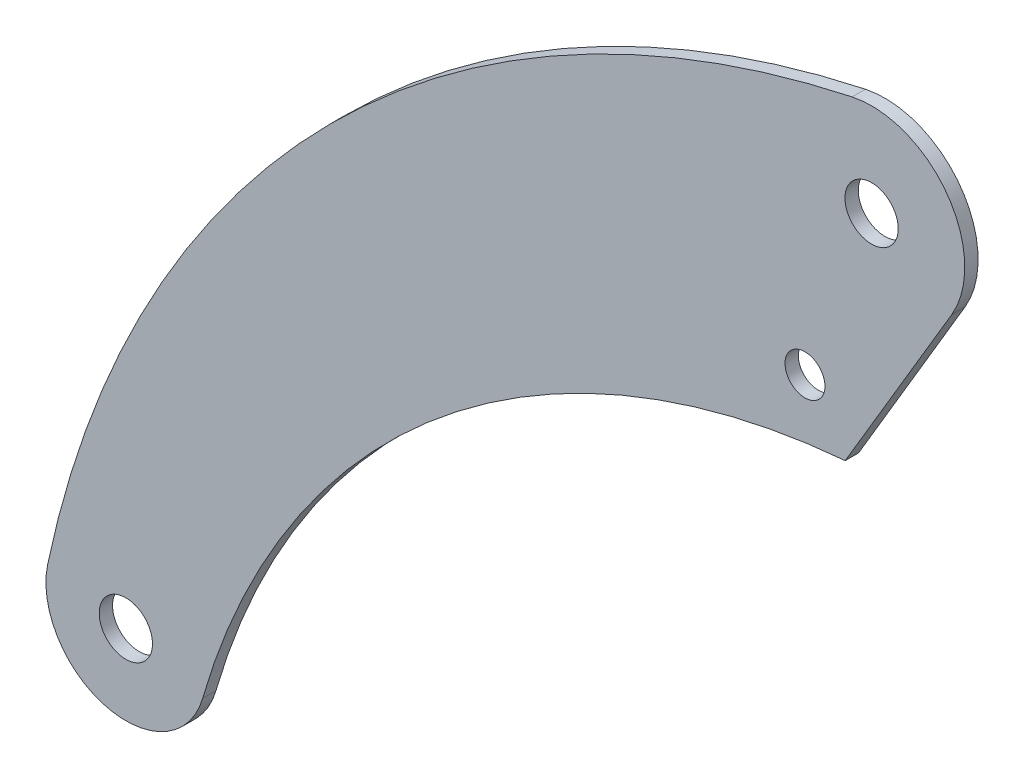
ISO-10303-21;
HEADER;
FILE_DESCRIPTION(('STEP AP214'),'2;1');
FILE_NAME('part.step','',(''),(''),'','','');
FILE_SCHEMA(('AUTOMOTIVE_DESIGN { 1 0 10303 214 1 1 1 1 }'));
ENDSEC;
DATA;
#1=APPLICATION_CONTEXT('core data for automotive mechanical design processes');
#2=APPLICATION_PROTOCOL_DEFINITION('international standard','automotive_design',2000,#1);
#3=PRODUCT_CONTEXT('',#1,'mechanical');
#4=PRODUCT('Part','Part','',(#3));
#5=PRODUCT_RELATED_PRODUCT_CATEGORY('part','',(#4));
#6=PRODUCT_DEFINITION_FORMATION('','',#4);
#7=PRODUCT_DEFINITION_CONTEXT('part definition',#1,'design');
#8=PRODUCT_DEFINITION('design','',#6,#7);
#9=PRODUCT_DEFINITION_SHAPE('','',#8);
#10=(LENGTH_UNIT() NAMED_UNIT(*) SI_UNIT(.MILLI.,.METRE.));
#11=(NAMED_UNIT(*) PLANE_ANGLE_UNIT() SI_UNIT($,.RADIAN.));
#12=(NAMED_UNIT(*) SI_UNIT($,.STERADIAN.) SOLID_ANGLE_UNIT());
#13=UNCERTAINTY_MEASURE_WITH_UNIT(LENGTH_MEASURE(1.E-05),#10,'distance_accuracy_value','');
#14=(GEOMETRIC_REPRESENTATION_CONTEXT(3) GLOBAL_UNCERTAINTY_ASSIGNED_CONTEXT((#13)) GLOBAL_UNIT_ASSIGNED_CONTEXT((#10,
#11,#12)) REPRESENTATION_CONTEXT('',''));
#15=CARTESIAN_POINT('',(0.,0.,0.));
#16=DIRECTION('',(0.,0.,1.));
#17=DIRECTION('',(1.,0.,0.));
#18=AXIS2_PLACEMENT_3D('',#15,#16,#17);
#19=CARTESIAN_POINT('',(0.,0.,5.));
#20=DIRECTION('',(0.,0.,1.));
#21=DIRECTION('',(1.,0.,0.));
#22=AXIS2_PLACEMENT_3D('',#19,#20,#21);
#23=PLANE('',#22);
#24=CARTESIAN_POINT('',(-50.,-130.,5.));
#25=DIRECTION('',(0.,0.,1.));
#26=DIRECTION('',(1.,0.,0.));
#27=AXIS2_PLACEMENT_3D('',#24,#25,#26);
#28=CIRCLE('',#27,15.);
#29=CARTESIAN_POINT('',(-35.,-130.,5.));
#30=VERTEX_POINT('',#29);
#31=EDGE_CURVE('E167',#30,#30,#28,.T.);
#32=ORIENTED_EDGE('',*,*,#31,.F.);
#33=EDGE_LOOP('',(#32));
#34=FACE_BOUND('',#33,.T.);
#35=CARTESIAN_POINT('',(0.,0.,5.));
#36=DIRECTION('',(0.,0.,1.));
#37=DIRECTION('',(1.,0.,0.));
#38=AXIS2_PLACEMENT_3D('',#35,#36,#37);
#39=CIRCLE('',#38,70.);
#40=CARTESIAN_POINT('',(60.2204073543922,-35.6861673211213,5.));
#41=VERTEX_POINT('',#40);
#42=CARTESIAN_POINT('',(-14.634584070682,68.4531149698693,5.));
#43=VERTEX_POINT('',#42);
#44=EDGE_CURVE('E117',#41,#43,#39,.T.);
#45=ORIENTED_EDGE('',*,*,#44,.T.);
#46=CARTESIAN_POINT('',(149.481823007681,-699.199674335093,5.));
#47=DIRECTION('',(0.,0.,1.));
#48=DIRECTION('',(1.,0.,0.));
#49=AXIS2_PLACEMENT_3D('',#46,#47,#48);
#50=CIRCLE('',#49,785.);
#51=CARTESIAN_POINT('',(-618.715737076498,-537.652440744682,5.));
#52=VERTEX_POINT('',#51);
#53=EDGE_CURVE('E84',#43,#52,#50,.T.);
#54=ORIENTED_EDGE('',*,*,#53,.T.);
#55=CARTESIAN_POINT('',(-560.,-550.,5.));
#56=DIRECTION('',(0.,0.,1.));
#57=DIRECTION('',(-1.,0.,0.));
#58=AXIS2_PLACEMENT_3D('',#55,#56,#57);
#59=CIRCLE('',#58,60.);
#60=CARTESIAN_POINT('',(-502.341900982989,-566.599506551236,5.));
#61=VERTEX_POINT('',#60);
#62=EDGE_CURVE('E88',#52,#61,#59,.T.);
#63=ORIENTED_EDGE('',*,*,#62,.T.);
#64=CARTESIAN_POINT('',(26.1906733396146,-718.761649937565,5.));
#65=DIRECTION('',(0.,0.,-1.));
#66=DIRECTION('',(1.,0.,0.));
#67=AXIS2_PLACEMENT_3D('',#64,#65,#66);
#68=CIRCLE('',#67,550.);
#69=CARTESIAN_POINT('',(-19.7795926456078,-170.686167321121,5.));
#70=VERTEX_POINT('',#69);
#71=EDGE_CURVE('E92',#61,#70,#68,.T.);
#72=ORIENTED_EDGE('',*,*,#71,.T.);
#73=DIRECTION('',(0.509802390301733,0.860291533634175,0.));
#74=VECTOR('',#73,1.);
#75=CARTESIAN_POINT('',(60.2204073543922,-35.6861673211213,5.));
#76=LINE('',#75,#74);
#77=EDGE_CURVE('E50',#70,#41,#76,.T.);
#78=ORIENTED_EDGE('',*,*,#77,.T.);
#79=EDGE_LOOP('',(#45,#54,#63,#72,#78));
#80=FACE_BOUND('',#79,.T.);
#81=CARTESIAN_POINT('',(0.,0.,5.));
#82=DIRECTION('',(0.,0.,1.));
#83=DIRECTION('',(1.,0.,0.));
#84=AXIS2_PLACEMENT_3D('',#81,#82,#83);
#85=CIRCLE('',#84,20.);
#86=CARTESIAN_POINT('',(20.,0.,5.));
#87=VERTEX_POINT('',#86);
#88=EDGE_CURVE('E112',#87,#87,#85,.T.);
#89=ORIENTED_EDGE('',*,*,#88,.F.);
#90=EDGE_LOOP('',(#89));
#91=FACE_BOUND('',#90,.T.);
#92=CARTESIAN_POINT('',(-560.,-550.,5.));
#93=DIRECTION('',(0.,0.,1.));
#94=DIRECTION('',(1.,0.,0.));
#95=AXIS2_PLACEMENT_3D('',#92,#93,#94);
#96=CIRCLE('',#95,20.);
#97=CARTESIAN_POINT('',(-540.,-550.,5.));
#98=VERTEX_POINT('',#97);
#99=EDGE_CURVE('E158',#98,#98,#96,.T.);
#100=ORIENTED_EDGE('',*,*,#99,.F.);
#101=EDGE_LOOP('',(#100));
#102=FACE_BOUND('',#101,.T.);
#103=ADVANCED_FACE('F33',(#34,#80,#91,#102),#23,.T.);
#104=CARTESIAN_POINT('',(0.,0.,-5.));
#105=DIRECTION('',(0.,0.,1.));
#106=DIRECTION('',(1.,0.,0.));
#107=AXIS2_PLACEMENT_3D('',#104,#105,#106);
#108=PLANE('',#107);
#109=CARTESIAN_POINT('',(0.,0.,-5.));
#110=DIRECTION('',(0.,0.,1.));
#111=DIRECTION('',(1.,0.,0.));
#112=AXIS2_PLACEMENT_3D('',#109,#110,#111);
#113=CIRCLE('',#112,70.);
#114=CARTESIAN_POINT('',(60.2204073543922,-35.6861673211213,-5.));
#115=VERTEX_POINT('',#114);
#116=CARTESIAN_POINT('',(-14.634584070682,68.4531149698693,-5.));
#117=VERTEX_POINT('',#116);
#118=EDGE_CURVE('E108',#115,#117,#113,.T.);
#119=ORIENTED_EDGE('',*,*,#118,.F.);
#120=DIRECTION('',(0.509802390301733,0.860291533634175,0.));
#121=VECTOR('',#120,1.);
#122=CARTESIAN_POINT('',(60.2204073543922,-35.6861673211213,-5.));
#123=LINE('',#122,#121);
#124=CARTESIAN_POINT('',(-19.7795926456078,-170.686167321121,-5.));
#125=VERTEX_POINT('',#124);
#126=EDGE_CURVE('E76',#125,#115,#123,.T.);
#127=ORIENTED_EDGE('',*,*,#126,.F.);
#128=CARTESIAN_POINT('',(26.1906733396146,-718.761649937565,-5.));
#129=DIRECTION('',(0.,0.,-1.));
#130=DIRECTION('',(1.,0.,0.));
#131=AXIS2_PLACEMENT_3D('',#128,#129,#130);
#132=CIRCLE('',#131,550.);
#133=CARTESIAN_POINT('',(-502.341900982989,-566.599506551236,-5.));
#134=VERTEX_POINT('',#133);
#135=EDGE_CURVE('E70',#134,#125,#132,.T.);
#136=ORIENTED_EDGE('',*,*,#135,.F.);
#137=CARTESIAN_POINT('',(-560.,-550.,-5.));
#138=DIRECTION('',(0.,0.,1.));
#139=DIRECTION('',(-1.,0.,0.));
#140=AXIS2_PLACEMENT_3D('',#137,#138,#139);
#141=CIRCLE('',#140,60.);
#142=CARTESIAN_POINT('',(-618.715737076498,-537.652440744682,-5.));
#143=VERTEX_POINT('',#142);
#144=EDGE_CURVE('E99',#143,#134,#141,.T.);
#145=ORIENTED_EDGE('',*,*,#144,.F.);
#146=CARTESIAN_POINT('',(149.481823007681,-699.199674335093,-5.));
#147=DIRECTION('',(0.,0.,1.));
#148=DIRECTION('',(1.,0.,0.));
#149=AXIS2_PLACEMENT_3D('',#146,#147,#148);
#150=CIRCLE('',#149,785.);
#151=EDGE_CURVE('E111',#117,#143,#150,.T.);
#152=ORIENTED_EDGE('',*,*,#151,.F.);
#153=EDGE_LOOP('',(#119,#127,#136,#145,#152));
#154=FACE_BOUND('',#153,.T.);
#155=CARTESIAN_POINT('',(0.,0.,-5.));
#156=DIRECTION('',(0.,0.,1.));
#157=DIRECTION('',(1.,0.,0.));
#158=AXIS2_PLACEMENT_3D('',#155,#156,#157);
#159=CIRCLE('',#158,20.);
#160=CARTESIAN_POINT('',(20.,0.,-5.));
#161=VERTEX_POINT('',#160);
#162=EDGE_CURVE('E170',#161,#161,#159,.T.);
#163=ORIENTED_EDGE('',*,*,#162,.T.);
#164=EDGE_LOOP('',(#163));
#165=FACE_BOUND('',#164,.T.);
#166=CARTESIAN_POINT('',(-50.,-130.,-5.));
#167=DIRECTION('',(0.,0.,1.));
#168=DIRECTION('',(1.,0.,0.));
#169=AXIS2_PLACEMENT_3D('',#166,#167,#168);
#170=CIRCLE('',#169,15.);
#171=CARTESIAN_POINT('',(-35.,-130.,-5.));
#172=VERTEX_POINT('',#171);
#173=EDGE_CURVE('E164',#172,#172,#170,.T.);
#174=ORIENTED_EDGE('',*,*,#173,.T.);
#175=EDGE_LOOP('',(#174));
#176=FACE_BOUND('',#175,.T.);
#177=CARTESIAN_POINT('',(-560.,-550.,-5.));
#178=DIRECTION('',(0.,0.,1.));
#179=DIRECTION('',(1.,0.,0.));
#180=AXIS2_PLACEMENT_3D('',#177,#178,#179);
#181=CIRCLE('',#180,20.);
#182=CARTESIAN_POINT('',(-540.,-550.,-5.));
#183=VERTEX_POINT('',#182);
#184=EDGE_CURVE('E161',#183,#183,#181,.T.);
#185=ORIENTED_EDGE('',*,*,#184,.T.);
#186=EDGE_LOOP('',(#185));
#187=FACE_BOUND('',#186,.T.);
#188=ADVANCED_FACE('F121',(#154,#165,#176,#187),#108,.F.);
#189=CARTESIAN_POINT('',(0.,0.,5.));
#190=DIRECTION('',(0.,0.,-1.));
#191=DIRECTION('',(-1.,0.,0.));
#192=AXIS2_PLACEMENT_3D('',#189,#190,#191);
#193=CYLINDRICAL_SURFACE('',#192,70.);
#194=ORIENTED_EDGE('',*,*,#118,.T.);
#195=DIRECTION('',(0.,0.,-1.));
#196=VECTOR('',#195,1.);
#197=CARTESIAN_POINT('',(-14.634584070682,68.4531149698693,5.));
#198=LINE('',#197,#196);
#199=EDGE_CURVE('E11',#43,#117,#198,.T.);
#200=ORIENTED_EDGE('',*,*,#199,.F.);
#201=ORIENTED_EDGE('',*,*,#44,.F.);
#202=DIRECTION('',(0.,0.,-1.));
#203=VECTOR('',#202,1.);
#204=CARTESIAN_POINT('',(60.2204073543922,-35.6861673211213,5.));
#205=LINE('',#204,#203);
#206=EDGE_CURVE('E104',#41,#115,#205,.T.);
#207=ORIENTED_EDGE('',*,*,#206,.T.);
#208=EDGE_LOOP('',(#194,#200,#201,#207));
#209=FACE_BOUND('',#208,.T.);
#210=ADVANCED_FACE('F35',(#209),#193,.T.);
#211=CARTESIAN_POINT('',(149.481823007681,-699.199674335093,5.));
#212=DIRECTION('',(0.,0.,-1.));
#213=DIRECTION('',(-1.,0.,0.));
#214=AXIS2_PLACEMENT_3D('',#211,#212,#213);
#215=CYLINDRICAL_SURFACE('',#214,785.);
#216=ORIENTED_EDGE('',*,*,#151,.T.);
#217=DIRECTION('',(0.,0.,-1.));
#218=VECTOR('',#217,1.);
#219=CARTESIAN_POINT('',(-618.715737076498,-537.652440744682,5.));
#220=LINE('',#219,#218);
#221=EDGE_CURVE('E42',#52,#143,#220,.T.);
#222=ORIENTED_EDGE('',*,*,#221,.F.);
#223=ORIENTED_EDGE('',*,*,#53,.F.);
#224=ORIENTED_EDGE('',*,*,#199,.T.);
#225=EDGE_LOOP('',(#216,#222,#223,#224));
#226=FACE_BOUND('',#225,.T.);
#227=ADVANCED_FACE('F211',(#226),#215,.T.);
#228=CARTESIAN_POINT('',(-560.,-550.,5.));
#229=DIRECTION('',(0.,0.,-1.));
#230=DIRECTION('',(-1.,0.,0.));
#231=AXIS2_PLACEMENT_3D('',#228,#229,#230);
#232=CYLINDRICAL_SURFACE('',#231,60.);
#233=ORIENTED_EDGE('',*,*,#144,.T.);
#234=DIRECTION('',(0.,0.,-1.));
#235=VECTOR('',#234,1.);
#236=CARTESIAN_POINT('',(-502.341900982989,-566.599506551236,5.));
#237=LINE('',#236,#235);
#238=EDGE_CURVE('E96',#61,#134,#237,.T.);
#239=ORIENTED_EDGE('',*,*,#238,.F.);
#240=ORIENTED_EDGE('',*,*,#62,.F.);
#241=ORIENTED_EDGE('',*,*,#221,.T.);
#242=EDGE_LOOP('',(#233,#239,#240,#241));
#243=FACE_BOUND('',#242,.T.);
#244=ADVANCED_FACE('F97',(#243),#232,.T.);
#245=CARTESIAN_POINT('',(26.1906733396146,-718.761649937565,5.));
#246=DIRECTION('',(0.,0.,-1.));
#247=DIRECTION('',(-1.,0.,0.));
#248=AXIS2_PLACEMENT_3D('',#245,#246,#247);
#249=CYLINDRICAL_SURFACE('',#248,550.);
#250=ORIENTED_EDGE('',*,*,#135,.T.);
#251=DIRECTION('',(0.,0.,-1.));
#252=VECTOR('',#251,1.);
#253=CARTESIAN_POINT('',(-19.7795926456078,-170.686167321121,5.));
#254=LINE('',#253,#252);
#255=EDGE_CURVE('E100',#70,#125,#254,.T.);
#256=ORIENTED_EDGE('',*,*,#255,.F.);
#257=ORIENTED_EDGE('',*,*,#71,.F.);
#258=ORIENTED_EDGE('',*,*,#238,.T.);
#259=EDGE_LOOP('',(#250,#256,#257,#258));
#260=FACE_BOUND('',#259,.T.);
#261=ADVANCED_FACE('F102',(#260),#249,.F.);
#262=CARTESIAN_POINT('',(60.2204073543922,-35.6861673211213,5.));
#263=DIRECTION('',(-0.860291533634174,0.509802390301733,0.));
#264=DIRECTION('',(-0.509802390301733,-0.860291533634174,0.));
#265=AXIS2_PLACEMENT_3D('',#262,#263,#264);
#266=PLANE('',#265);
#267=ORIENTED_EDGE('',*,*,#126,.T.);
#268=ORIENTED_EDGE('',*,*,#206,.F.);
#269=ORIENTED_EDGE('',*,*,#77,.F.);
#270=ORIENTED_EDGE('',*,*,#255,.T.);
#271=EDGE_LOOP('',(#267,#268,#269,#270));
#272=FACE_BOUND('',#271,.T.);
#273=ADVANCED_FACE('F126',(#272),#266,.F.);
#274=CARTESIAN_POINT('',(0.,0.,5.));
#275=DIRECTION('',(0.,0.,-1.));
#276=DIRECTION('',(-1.,0.,0.));
#277=AXIS2_PLACEMENT_3D('',#274,#275,#276);
#278=CYLINDRICAL_SURFACE('',#277,20.);
#279=ORIENTED_EDGE('',*,*,#88,.T.);
#280=EDGE_LOOP('',(#279));
#281=FACE_BOUND('',#280,.T.);
#282=ORIENTED_EDGE('',*,*,#162,.F.);
#283=EDGE_LOOP('',(#282));
#284=FACE_BOUND('',#283,.T.);
#285=ADVANCED_FACE('F128',(#281,#284),#278,.F.);
#286=CARTESIAN_POINT('',(-50.,-130.,5.));
#287=DIRECTION('',(0.,0.,-1.));
#288=DIRECTION('',(-1.,0.,0.));
#289=AXIS2_PLACEMENT_3D('',#286,#287,#288);
#290=CYLINDRICAL_SURFACE('',#289,15.);
#291=ORIENTED_EDGE('',*,*,#31,.T.);
#292=EDGE_LOOP('',(#291));
#293=FACE_BOUND('',#292,.T.);
#294=ORIENTED_EDGE('',*,*,#173,.F.);
#295=EDGE_LOOP('',(#294));
#296=FACE_BOUND('',#295,.T.);
#297=ADVANCED_FACE('F134',(#293,#296),#290,.F.);
#298=CARTESIAN_POINT('',(-560.,-550.,5.));
#299=DIRECTION('',(0.,0.,-1.));
#300=DIRECTION('',(-1.,0.,0.));
#301=AXIS2_PLACEMENT_3D('',#298,#299,#300);
#302=CYLINDRICAL_SURFACE('',#301,20.);
#303=ORIENTED_EDGE('',*,*,#99,.T.);
#304=EDGE_LOOP('',(#303));
#305=FACE_BOUND('',#304,.T.);
#306=ORIENTED_EDGE('',*,*,#184,.F.);
#307=EDGE_LOOP('',(#306));
#308=FACE_BOUND('',#307,.T.);
#309=ADVANCED_FACE('F149',(#305,#308),#302,.F.);
#310=CLOSED_SHELL('',(#103,#188,#210,#227,#244,#261,#273,#285,#297,#309));
#311=MANIFOLD_SOLID_BREP('B2',#310);
#312=ADVANCED_BREP_SHAPE_REPRESENTATION('',(#18,#311),#14);
#313=SHAPE_DEFINITION_REPRESENTATION(#9,#312);
ENDSEC;
END-ISO-10303-21;
